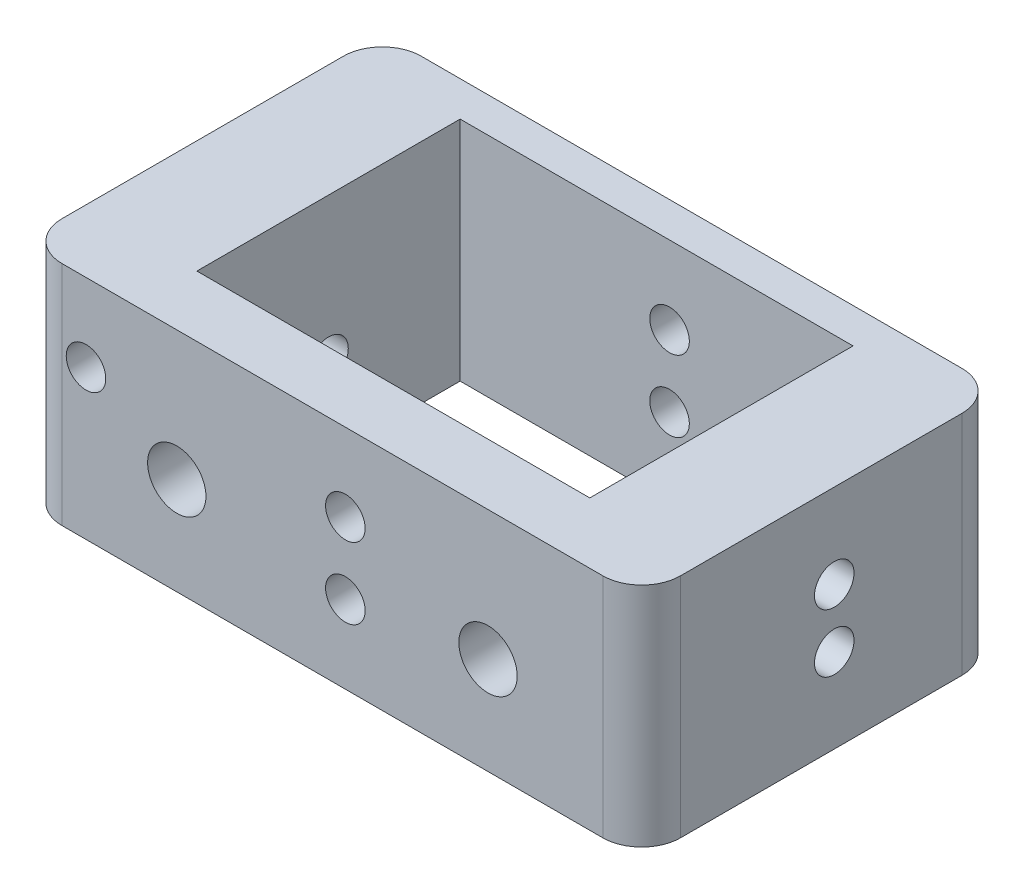
ISO-10303-21;
HEADER;
FILE_DESCRIPTION(('STEP AP214'),'2;1');
FILE_NAME('part.step','',(''),(''),'','','');
FILE_SCHEMA(('AUTOMOTIVE_DESIGN { 1 0 10303 214 1 1 1 1 }'));
ENDSEC;
DATA;
#1=APPLICATION_CONTEXT('core data for automotive mechanical design processes');
#2=APPLICATION_PROTOCOL_DEFINITION('international standard','automotive_design',2000,#1);
#3=PRODUCT_CONTEXT('',#1,'mechanical');
#4=PRODUCT('Part','Part','',(#3));
#5=PRODUCT_RELATED_PRODUCT_CATEGORY('part','',(#4));
#6=PRODUCT_DEFINITION_FORMATION('','',#4);
#7=PRODUCT_DEFINITION_CONTEXT('part definition',#1,'design');
#8=PRODUCT_DEFINITION('design','',#6,#7);
#9=PRODUCT_DEFINITION_SHAPE('','',#8);
#10=(LENGTH_UNIT() NAMED_UNIT(*) SI_UNIT(.MILLI.,.METRE.));
#11=(NAMED_UNIT(*) PLANE_ANGLE_UNIT() SI_UNIT($,.RADIAN.));
#12=(NAMED_UNIT(*) SI_UNIT($,.STERADIAN.) SOLID_ANGLE_UNIT());
#13=UNCERTAINTY_MEASURE_WITH_UNIT(LENGTH_MEASURE(1.E-05),#10,'distance_accuracy_value','');
#14=(GEOMETRIC_REPRESENTATION_CONTEXT(3) GLOBAL_UNCERTAINTY_ASSIGNED_CONTEXT((#13)) GLOBAL_UNIT_ASSIGNED_CONTEXT((#10,
#11,#12)) REPRESENTATION_CONTEXT('',''));
#15=CARTESIAN_POINT('',(0.,0.,0.));
#16=DIRECTION('',(0.,0.,1.));
#17=DIRECTION('',(1.,0.,0.));
#18=AXIS2_PLACEMENT_3D('',#15,#16,#17);
#19=CARTESIAN_POINT('',(0.,8.75,0.));
#20=DIRECTION('',(0.,-1.,0.));
#21=DIRECTION('',(0.,0.,-1.));
#22=AXIS2_PLACEMENT_3D('',#19,#20,#21);
#23=PLANE('',#22);
#24=DIRECTION('',(1.,0.,0.));
#25=VECTOR('',#24,1.);
#26=CARTESIAN_POINT('',(-23.85,8.75,13.85));
#27=LINE('',#26,#25);
#28=CARTESIAN_POINT('',(-20.85,8.75,13.85));
#29=VERTEX_POINT('',#28);
#30=CARTESIAN_POINT('',(20.85,8.75,13.85));
#31=VERTEX_POINT('',#30);
#32=EDGE_CURVE('E199',#29,#31,#27,.T.);
#33=ORIENTED_EDGE('',*,*,#32,.T.);
#34=CARTESIAN_POINT('',(20.85,8.75,10.85));
#35=DIRECTION('',(0.,-1.,0.));
#36=DIRECTION('',(0.,0.,-1.));
#37=AXIS2_PLACEMENT_3D('',#34,#35,#36);
#38=CIRCLE('',#37,3.);
#39=CARTESIAN_POINT('',(23.85,8.75,10.85));
#40=VERTEX_POINT('',#39);
#41=EDGE_CURVE('E277',#31,#40,#38,.F.);
#42=ORIENTED_EDGE('',*,*,#41,.T.);
#43=DIRECTION('',(0.,0.,-1.));
#44=VECTOR('',#43,1.);
#45=CARTESIAN_POINT('',(23.85,8.75,13.85));
#46=LINE('',#45,#44);
#47=CARTESIAN_POINT('',(23.85,8.75,-10.85));
#48=VERTEX_POINT('',#47);
#49=EDGE_CURVE('E189',#40,#48,#46,.T.);
#50=ORIENTED_EDGE('',*,*,#49,.T.);
#51=CARTESIAN_POINT('',(20.85,8.75,-10.85));
#52=DIRECTION('',(0.,-1.,0.));
#53=DIRECTION('',(0.,0.,-1.));
#54=AXIS2_PLACEMENT_3D('',#51,#52,#53);
#55=CIRCLE('',#54,3.);
#56=CARTESIAN_POINT('',(20.85,8.75,-13.85));
#57=VERTEX_POINT('',#56);
#58=EDGE_CURVE('E272',#48,#57,#55,.F.);
#59=ORIENTED_EDGE('',*,*,#58,.T.);
#60=DIRECTION('',(-1.,0.,0.));
#61=VECTOR('',#60,1.);
#62=CARTESIAN_POINT('',(-23.85,8.75,-13.85));
#63=LINE('',#62,#61);
#64=CARTESIAN_POINT('',(-20.85,8.75,-13.85));
#65=VERTEX_POINT('',#64);
#66=EDGE_CURVE('E193',#57,#65,#63,.T.);
#67=ORIENTED_EDGE('',*,*,#66,.T.);
#68=CARTESIAN_POINT('',(-20.85,8.75,-10.85));
#69=DIRECTION('',(0.,-1.,0.));
#70=DIRECTION('',(0.,0.,-1.));
#71=AXIS2_PLACEMENT_3D('',#68,#69,#70);
#72=CIRCLE('',#71,3.);
#73=CARTESIAN_POINT('',(-23.85,8.75,-10.85));
#74=VERTEX_POINT('',#73);
#75=EDGE_CURVE('E63',#65,#74,#72,.F.);
#76=ORIENTED_EDGE('',*,*,#75,.T.);
#77=DIRECTION('',(0.,0.,1.));
#78=VECTOR('',#77,1.);
#79=CARTESIAN_POINT('',(-23.85,8.75,13.85));
#80=LINE('',#79,#78);
#81=CARTESIAN_POINT('',(-23.85,8.75,10.85));
#82=VERTEX_POINT('',#81);
#83=EDGE_CURVE('E197',#74,#82,#80,.T.);
#84=ORIENTED_EDGE('',*,*,#83,.T.);
#85=CARTESIAN_POINT('',(-20.85,8.75,10.85));
#86=DIRECTION('',(0.,-1.,0.));
#87=DIRECTION('',(0.,0.,-1.));
#88=AXIS2_PLACEMENT_3D('',#85,#86,#87);
#89=CIRCLE('',#88,3.);
#90=EDGE_CURVE('E269',#82,#29,#89,.F.);
#91=ORIENTED_EDGE('',*,*,#90,.T.);
#92=EDGE_LOOP('',(#33,#42,#50,#59,#67,#76,#84,#91));
#93=FACE_BOUND('',#92,.T.);
#94=DIRECTION('',(0.,0.,-1.));
#95=VECTOR('',#94,1.);
#96=CARTESIAN_POINT('',(15.15,8.75,9.15));
#97=LINE('',#96,#95);
#98=CARTESIAN_POINT('',(15.15,8.75,9.15));
#99=VERTEX_POINT('',#98);
#100=CARTESIAN_POINT('',(15.15,8.75,-11.15));
#101=VERTEX_POINT('',#100);
#102=EDGE_CURVE('E132',#99,#101,#97,.T.);
#103=ORIENTED_EDGE('',*,*,#102,.F.);
#104=DIRECTION('',(1.,0.,0.));
#105=VECTOR('',#104,1.);
#106=CARTESIAN_POINT('',(-15.15,8.75,9.15));
#107=LINE('',#106,#105);
#108=CARTESIAN_POINT('',(-15.15,8.75,9.15));
#109=VERTEX_POINT('',#108);
#110=EDGE_CURVE('E163',#109,#99,#107,.T.);
#111=ORIENTED_EDGE('',*,*,#110,.F.);
#112=DIRECTION('',(0.,0.,1.));
#113=VECTOR('',#112,1.);
#114=CARTESIAN_POINT('',(-15.15,8.75,9.15));
#115=LINE('',#114,#113);
#116=CARTESIAN_POINT('',(-15.15,8.75,-11.15));
#117=VERTEX_POINT('',#116);
#118=EDGE_CURVE('E157',#117,#109,#115,.T.);
#119=ORIENTED_EDGE('',*,*,#118,.F.);
#120=DIRECTION('',(-1.,0.,0.));
#121=VECTOR('',#120,1.);
#122=CARTESIAN_POINT('',(-15.15,8.75,-11.15));
#123=LINE('',#122,#121);
#124=EDGE_CURVE('E143',#101,#117,#123,.T.);
#125=ORIENTED_EDGE('',*,*,#124,.F.);
#126=EDGE_LOOP('',(#103,#111,#119,#125));
#127=FACE_BOUND('',#126,.T.);
#128=ADVANCED_FACE('F40',(#93,#127),#23,.F.);
#129=CARTESIAN_POINT('',(0.,-8.75,0.));
#130=DIRECTION('',(0.,-1.,0.));
#131=DIRECTION('',(0.,0.,-1.));
#132=AXIS2_PLACEMENT_3D('',#129,#130,#131);
#133=PLANE('',#132);
#134=DIRECTION('',(0.,0.,-1.));
#135=VECTOR('',#134,1.);
#136=CARTESIAN_POINT('',(23.85,-8.75,13.85));
#137=LINE('',#136,#135);
#138=CARTESIAN_POINT('',(23.85,-8.75,10.85));
#139=VERTEX_POINT('',#138);
#140=CARTESIAN_POINT('',(23.85,-8.75,-10.85));
#141=VERTEX_POINT('',#140);
#142=EDGE_CURVE('E152',#139,#141,#137,.T.);
#143=ORIENTED_EDGE('',*,*,#142,.F.);
#144=CARTESIAN_POINT('',(20.85,-8.75,10.85));
#145=DIRECTION('',(0.,-1.,0.));
#146=DIRECTION('',(0.,0.,-1.));
#147=AXIS2_PLACEMENT_3D('',#144,#145,#146);
#148=CIRCLE('',#147,3.);
#149=CARTESIAN_POINT('',(20.85,-8.75,13.85));
#150=VERTEX_POINT('',#149);
#151=EDGE_CURVE('E259',#139,#150,#148,.T.);
#152=ORIENTED_EDGE('',*,*,#151,.T.);
#153=DIRECTION('',(1.,0.,0.));
#154=VECTOR('',#153,1.);
#155=CARTESIAN_POINT('',(-23.85,-8.75,13.85));
#156=LINE('',#155,#154);
#157=CARTESIAN_POINT('',(-20.85,-8.75,13.85));
#158=VERTEX_POINT('',#157);
#159=EDGE_CURVE('E194',#158,#150,#156,.T.);
#160=ORIENTED_EDGE('',*,*,#159,.F.);
#161=CARTESIAN_POINT('',(-20.85,-8.75,10.85));
#162=DIRECTION('',(0.,-1.,0.));
#163=DIRECTION('',(0.,0.,-1.));
#164=AXIS2_PLACEMENT_3D('',#161,#162,#163);
#165=CIRCLE('',#164,3.);
#166=CARTESIAN_POINT('',(-23.85,-8.75,10.85));
#167=VERTEX_POINT('',#166);
#168=EDGE_CURVE('E250',#158,#167,#165,.T.);
#169=ORIENTED_EDGE('',*,*,#168,.T.);
#170=DIRECTION('',(0.,0.,1.));
#171=VECTOR('',#170,1.);
#172=CARTESIAN_POINT('',(-23.85,-8.75,13.85));
#173=LINE('',#172,#171);
#174=CARTESIAN_POINT('',(-23.85,-8.75,-10.85));
#175=VERTEX_POINT('',#174);
#176=EDGE_CURVE('E211',#175,#167,#173,.T.);
#177=ORIENTED_EDGE('',*,*,#176,.F.);
#178=CARTESIAN_POINT('',(-20.85,-8.75,-10.85));
#179=DIRECTION('',(0.,-1.,0.));
#180=DIRECTION('',(0.,0.,-1.));
#181=AXIS2_PLACEMENT_3D('',#178,#179,#180);
#182=CIRCLE('',#181,3.);
#183=CARTESIAN_POINT('',(-20.85,-8.75,-13.85));
#184=VERTEX_POINT('',#183);
#185=EDGE_CURVE('E256',#175,#184,#182,.T.);
#186=ORIENTED_EDGE('',*,*,#185,.T.);
#187=DIRECTION('',(-1.,0.,0.));
#188=VECTOR('',#187,1.);
#189=CARTESIAN_POINT('',(-23.85,-8.75,-13.85));
#190=LINE('',#189,#188);
#191=CARTESIAN_POINT('',(20.85,-8.75,-13.85));
#192=VERTEX_POINT('',#191);
#193=EDGE_CURVE('E207',#192,#184,#190,.T.);
#194=ORIENTED_EDGE('',*,*,#193,.F.);
#195=CARTESIAN_POINT('',(20.85,-8.75,-10.85));
#196=DIRECTION('',(0.,-1.,0.));
#197=DIRECTION('',(0.,0.,-1.));
#198=AXIS2_PLACEMENT_3D('',#195,#196,#197);
#199=CIRCLE('',#198,3.);
#200=EDGE_CURVE('E253',#192,#141,#199,.T.);
#201=ORIENTED_EDGE('',*,*,#200,.T.);
#202=EDGE_LOOP('',(#143,#152,#160,#169,#177,#186,#194,#201));
#203=FACE_BOUND('',#202,.T.);
#204=DIRECTION('',(1.,0.,0.));
#205=VECTOR('',#204,1.);
#206=CARTESIAN_POINT('',(-15.15,-8.75,9.15));
#207=LINE('',#206,#205);
#208=CARTESIAN_POINT('',(-15.15,-8.75,9.15));
#209=VERTEX_POINT('',#208);
#210=CARTESIAN_POINT('',(15.15,-8.75,9.15));
#211=VERTEX_POINT('',#210);
#212=EDGE_CURVE('E144',#209,#211,#207,.T.);
#213=ORIENTED_EDGE('',*,*,#212,.T.);
#214=DIRECTION('',(0.,0.,-1.));
#215=VECTOR('',#214,1.);
#216=CARTESIAN_POINT('',(15.15,-8.75,9.15));
#217=LINE('',#216,#215);
#218=CARTESIAN_POINT('',(15.15,-8.75,-11.15));
#219=VERTEX_POINT('',#218);
#220=EDGE_CURVE('E169',#211,#219,#217,.T.);
#221=ORIENTED_EDGE('',*,*,#220,.T.);
#222=DIRECTION('',(-1.,0.,0.));
#223=VECTOR('',#222,1.);
#224=CARTESIAN_POINT('',(-15.15,-8.75,-11.15));
#225=LINE('',#224,#223);
#226=CARTESIAN_POINT('',(-15.15,-8.75,-11.15));
#227=VERTEX_POINT('',#226);
#228=EDGE_CURVE('E150',#219,#227,#225,.T.);
#229=ORIENTED_EDGE('',*,*,#228,.T.);
#230=DIRECTION('',(0.,0.,1.));
#231=VECTOR('',#230,1.);
#232=CARTESIAN_POINT('',(-15.15,-8.75,9.15));
#233=LINE('',#232,#231);
#234=EDGE_CURVE('E175',#227,#209,#233,.T.);
#235=ORIENTED_EDGE('',*,*,#234,.T.);
#236=EDGE_LOOP('',(#213,#221,#229,#235));
#237=FACE_BOUND('',#236,.T.);
#238=ADVANCED_FACE('F297',(#203,#237),#133,.T.);
#239=CARTESIAN_POINT('',(23.85,8.75,13.85));
#240=DIRECTION('',(-1.,0.,0.));
#241=DIRECTION('',(0.,0.,1.));
#242=AXIS2_PLACEMENT_3D('',#239,#240,#241);
#243=PLANE('',#242);
#244=CARTESIAN_POINT('',(23.85,2.25,-1.00000000000005));
#245=DIRECTION('',(1.,0.,0.));
#246=DIRECTION('',(0.,0.,-1.));
#247=AXIS2_PLACEMENT_3D('',#244,#245,#246);
#248=CIRCLE('',#247,1.525);
#249=CARTESIAN_POINT('',(23.85,2.25,-2.52500000000005));
#250=VERTEX_POINT('',#249);
#251=EDGE_CURVE('E450',#250,#250,#248,.T.);
#252=ORIENTED_EDGE('',*,*,#251,.F.);
#253=EDGE_LOOP('',(#252));
#254=FACE_BOUND('',#253,.T.);
#255=CARTESIAN_POINT('',(23.85,-2.25,-0.999999999999973));
#256=DIRECTION('',(1.,0.,0.));
#257=DIRECTION('',(0.,0.,-1.));
#258=AXIS2_PLACEMENT_3D('',#255,#256,#257);
#259=CIRCLE('',#258,1.525);
#260=CARTESIAN_POINT('',(23.85,-2.25,-2.52499999999997));
#261=VERTEX_POINT('',#260);
#262=EDGE_CURVE('E420',#261,#261,#259,.T.);
#263=ORIENTED_EDGE('',*,*,#262,.F.);
#264=EDGE_LOOP('',(#263));
#265=FACE_BOUND('',#264,.T.);
#266=ORIENTED_EDGE('',*,*,#49,.F.);
#267=DIRECTION('',(0.,-1.,0.));
#268=VECTOR('',#267,1.);
#269=CARTESIAN_POINT('',(23.85,8.75,10.85));
#270=LINE('',#269,#268);
#271=EDGE_CURVE('E246',#40,#139,#270,.T.);
#272=ORIENTED_EDGE('',*,*,#271,.T.);
#273=ORIENTED_EDGE('',*,*,#142,.T.);
#274=DIRECTION('',(0.,-1.,0.));
#275=VECTOR('',#274,1.);
#276=CARTESIAN_POINT('',(23.85,8.75,-10.85));
#277=LINE('',#276,#275);
#278=EDGE_CURVE('E203',#141,#48,#277,.F.);
#279=ORIENTED_EDGE('',*,*,#278,.T.);
#280=EDGE_LOOP('',(#266,#272,#273,#279));
#281=FACE_BOUND('',#280,.T.);
#282=ADVANCED_FACE('F318',(#254,#265,#281),#243,.F.);
#283=CARTESIAN_POINT('',(-23.85,8.75,-13.85));
#284=DIRECTION('',(0.,0.,1.));
#285=DIRECTION('',(1.,0.,0.));
#286=AXIS2_PLACEMENT_3D('',#283,#284,#285);
#287=PLANE('',#286);
#288=CARTESIAN_POINT('',(1.000000000001,-2.75,-13.85));
#289=DIRECTION('',(0.,0.,1.));
#290=DIRECTION('',(1.,0.,0.));
#291=AXIS2_PLACEMENT_3D('',#288,#289,#290);
#292=CIRCLE('',#291,1.52500000000001);
#293=CARTESIAN_POINT('',(2.52500000000102,-2.75,-13.85));
#294=VERTEX_POINT('',#293);
#295=EDGE_CURVE('E438',#294,#294,#292,.T.);
#296=ORIENTED_EDGE('',*,*,#295,.T.);
#297=EDGE_LOOP('',(#296));
#298=FACE_BOUND('',#297,.T.);
#299=CARTESIAN_POINT('',(-18.999999999999,2.75000000000017,-13.85));
#300=DIRECTION('',(0.,0.,-1.));
#301=DIRECTION('',(-1.,0.,0.));
#302=AXIS2_PLACEMENT_3D('',#299,#300,#301);
#303=CIRCLE('',#302,1.52499999999997);
#304=CARTESIAN_POINT('',(-20.524999999999,2.75000000000017,-13.85));
#305=VERTEX_POINT('',#304);
#306=EDGE_CURVE('E237',#305,#305,#303,.T.);
#307=ORIENTED_EDGE('',*,*,#306,.F.);
#308=EDGE_LOOP('',(#307));
#309=FACE_BOUND('',#308,.T.);
#310=CARTESIAN_POINT('',(1.000000000001,2.75000000000009,-13.85));
#311=DIRECTION('',(0.,0.,-1.));
#312=DIRECTION('',(-1.,0.,0.));
#313=AXIS2_PLACEMENT_3D('',#310,#311,#312);
#314=CIRCLE('',#313,1.52499999999997);
#315=CARTESIAN_POINT('',(-0.524999999998968,2.75000000000009,-13.85));
#316=VERTEX_POINT('',#315);
#317=EDGE_CURVE('E411',#316,#316,#314,.T.);
#318=ORIENTED_EDGE('',*,*,#317,.F.);
#319=EDGE_LOOP('',(#318));
#320=FACE_BOUND('',#319,.T.);
#321=ORIENTED_EDGE('',*,*,#193,.T.);
#322=DIRECTION('',(0.,-1.,0.));
#323=VECTOR('',#322,1.);
#324=CARTESIAN_POINT('',(-20.85,8.75,-13.85));
#325=LINE('',#324,#323);
#326=EDGE_CURVE('E11',#184,#65,#325,.F.);
#327=ORIENTED_EDGE('',*,*,#326,.T.);
#328=ORIENTED_EDGE('',*,*,#66,.F.);
#329=DIRECTION('',(0.,-1.,0.));
#330=VECTOR('',#329,1.);
#331=CARTESIAN_POINT('',(20.85,8.75,-13.85));
#332=LINE('',#331,#330);
#333=EDGE_CURVE('E49',#57,#192,#332,.T.);
#334=ORIENTED_EDGE('',*,*,#333,.T.);
#335=EDGE_LOOP('',(#321,#327,#328,#334));
#336=FACE_BOUND('',#335,.T.);
#337=ADVANCED_FACE('F291',(#298,#309,#320,#336),#287,.F.);
#338=CARTESIAN_POINT('',(-23.85,8.75,13.85));
#339=DIRECTION('',(1.,0.,0.));
#340=DIRECTION('',(0.,0.,-1.));
#341=AXIS2_PLACEMENT_3D('',#338,#339,#340);
#342=PLANE('',#341);
#343=CARTESIAN_POINT('',(-23.85,-2.25,-0.999999999999973));
#344=DIRECTION('',(1.,0.,0.));
#345=DIRECTION('',(0.,0.,-1.));
#346=AXIS2_PLACEMENT_3D('',#343,#344,#345);
#347=CIRCLE('',#346,1.525);
#348=CARTESIAN_POINT('',(-23.85,-2.25,-2.52499999999997));
#349=VERTEX_POINT('',#348);
#350=EDGE_CURVE('E227',#349,#349,#347,.T.);
#351=ORIENTED_EDGE('',*,*,#350,.T.);
#352=EDGE_LOOP('',(#351));
#353=FACE_BOUND('',#352,.T.);
#354=ORIENTED_EDGE('',*,*,#83,.F.);
#355=DIRECTION('',(0.,-1.,0.));
#356=VECTOR('',#355,1.);
#357=CARTESIAN_POINT('',(-23.85,8.75,-10.85));
#358=LINE('',#357,#356);
#359=EDGE_CURVE('E282',#74,#175,#358,.T.);
#360=ORIENTED_EDGE('',*,*,#359,.T.);
#361=ORIENTED_EDGE('',*,*,#176,.T.);
#362=DIRECTION('',(0.,-1.,0.));
#363=VECTOR('',#362,1.);
#364=CARTESIAN_POINT('',(-23.85,8.75,10.85));
#365=LINE('',#364,#363);
#366=EDGE_CURVE('E56',#167,#82,#365,.F.);
#367=ORIENTED_EDGE('',*,*,#366,.T.);
#368=EDGE_LOOP('',(#354,#360,#361,#367));
#369=FACE_BOUND('',#368,.T.);
#370=ADVANCED_FACE('F303',(#353,#369),#342,.F.);
#371=CARTESIAN_POINT('',(-23.85,8.75,13.85));
#372=DIRECTION('',(0.,0.,-1.));
#373=DIRECTION('',(-1.,0.,0.));
#374=AXIS2_PLACEMENT_3D('',#371,#372,#373);
#375=PLANE('',#374);
#376=CARTESIAN_POINT('',(1.000000000001,-2.75,13.85));
#377=DIRECTION('',(0.,0.,-1.));
#378=DIRECTION('',(-1.,0.,0.));
#379=AXIS2_PLACEMENT_3D('',#376,#377,#378);
#380=CIRCLE('',#379,1.52500000000001);
#381=CARTESIAN_POINT('',(-0.524999999999011,-2.75,13.85));
#382=VERTEX_POINT('',#381);
#383=EDGE_CURVE('E243',#382,#382,#380,.T.);
#384=ORIENTED_EDGE('',*,*,#383,.T.);
#385=EDGE_LOOP('',(#384));
#386=FACE_BOUND('',#385,.T.);
#387=CARTESIAN_POINT('',(-12.0000000000443,-1.25000000000219,13.85));
#388=DIRECTION('',(0.,0.,1.));
#389=DIRECTION('',(1.,0.,0.));
#390=AXIS2_PLACEMENT_3D('',#387,#388,#389);
#391=CIRCLE('',#390,2.25);
#392=CARTESIAN_POINT('',(-9.75000000004425,-1.25000000000219,13.85));
#393=VERTEX_POINT('',#392);
#394=EDGE_CURVE('E233',#393,#393,#391,.T.);
#395=ORIENTED_EDGE('',*,*,#394,.F.);
#396=EDGE_LOOP('',(#395));
#397=FACE_BOUND('',#396,.T.);
#398=CARTESIAN_POINT('',(12.0000000000013,-1.25000000000008,13.85));
#399=DIRECTION('',(0.,0.,1.));
#400=DIRECTION('',(1.,0.,0.));
#401=AXIS2_PLACEMENT_3D('',#398,#399,#400);
#402=CIRCLE('',#401,2.25);
#403=CARTESIAN_POINT('',(14.2500000000013,-1.25000000000008,13.85));
#404=VERTEX_POINT('',#403);
#405=EDGE_CURVE('E434',#404,#404,#402,.T.);
#406=ORIENTED_EDGE('',*,*,#405,.F.);
#407=EDGE_LOOP('',(#406));
#408=FACE_BOUND('',#407,.T.);
#409=CARTESIAN_POINT('',(-18.999999999999,2.75000000000017,13.85));
#410=DIRECTION('',(0.,0.,-1.));
#411=DIRECTION('',(-1.,0.,0.));
#412=AXIS2_PLACEMENT_3D('',#409,#410,#411);
#413=CIRCLE('',#412,1.52499999999997);
#414=CARTESIAN_POINT('',(-20.524999999999,2.75000000000017,13.85));
#415=VERTEX_POINT('',#414);
#416=EDGE_CURVE('E424',#415,#415,#413,.T.);
#417=ORIENTED_EDGE('',*,*,#416,.T.);
#418=EDGE_LOOP('',(#417));
#419=FACE_BOUND('',#418,.T.);
#420=CARTESIAN_POINT('',(1.000000000001,2.75000000000009,13.85));
#421=DIRECTION('',(0.,0.,-1.));
#422=DIRECTION('',(-1.,0.,0.));
#423=AXIS2_PLACEMENT_3D('',#420,#421,#422);
#424=CIRCLE('',#423,1.52499999999997);
#425=CARTESIAN_POINT('',(-0.524999999998968,2.75000000000009,13.85));
#426=VERTEX_POINT('',#425);
#427=EDGE_CURVE('E221',#426,#426,#424,.T.);
#428=ORIENTED_EDGE('',*,*,#427,.T.);
#429=EDGE_LOOP('',(#428));
#430=FACE_BOUND('',#429,.T.);
#431=ORIENTED_EDGE('',*,*,#159,.T.);
#432=DIRECTION('',(0.,-1.,0.));
#433=VECTOR('',#432,1.);
#434=CARTESIAN_POINT('',(20.85,8.75,13.85));
#435=LINE('',#434,#433);
#436=EDGE_CURVE('E266',#150,#31,#435,.F.);
#437=ORIENTED_EDGE('',*,*,#436,.T.);
#438=ORIENTED_EDGE('',*,*,#32,.F.);
#439=DIRECTION('',(0.,-1.,0.));
#440=VECTOR('',#439,1.);
#441=CARTESIAN_POINT('',(-20.85,8.75,13.85));
#442=LINE('',#441,#440);
#443=EDGE_CURVE('E262',#29,#158,#442,.T.);
#444=ORIENTED_EDGE('',*,*,#443,.T.);
#445=EDGE_LOOP('',(#431,#437,#438,#444));
#446=FACE_BOUND('',#445,.T.);
#447=ADVANCED_FACE('F310',(#386,#397,#408,#419,#430,#446),#375,.F.);
#448=CARTESIAN_POINT('',(15.15,8.75,9.15));
#449=DIRECTION('',(-1.,0.,0.));
#450=DIRECTION('',(0.,0.,1.));
#451=AXIS2_PLACEMENT_3D('',#448,#449,#450);
#452=PLANE('',#451);
#453=CARTESIAN_POINT('',(15.15,2.25,-1.00000000000005));
#454=DIRECTION('',(-1.,0.,0.));
#455=DIRECTION('',(0.,0.,1.));
#456=AXIS2_PLACEMENT_3D('',#453,#454,#455);
#457=CIRCLE('',#456,1.525);
#458=CARTESIAN_POINT('',(15.15,2.25,0.524999999999951));
#459=VERTEX_POINT('',#458);
#460=EDGE_CURVE('E454',#459,#459,#457,.F.);
#461=ORIENTED_EDGE('',*,*,#460,.T.);
#462=EDGE_LOOP('',(#461));
#463=FACE_BOUND('',#462,.T.);
#464=CARTESIAN_POINT('',(15.15,-2.25,-0.999999999999973));
#465=DIRECTION('',(-1.,0.,0.));
#466=DIRECTION('',(0.,0.,1.));
#467=AXIS2_PLACEMENT_3D('',#464,#465,#466);
#468=CIRCLE('',#467,1.525);
#469=CARTESIAN_POINT('',(15.15,-2.25,0.525000000000027));
#470=VERTEX_POINT('',#469);
#471=EDGE_CURVE('E226',#470,#470,#468,.T.);
#472=ORIENTED_EDGE('',*,*,#471,.F.);
#473=EDGE_LOOP('',(#472));
#474=FACE_BOUND('',#473,.T.);
#475=ORIENTED_EDGE('',*,*,#220,.F.);
#476=DIRECTION('',(0.,-1.,0.));
#477=VECTOR('',#476,1.);
#478=CARTESIAN_POINT('',(15.15,8.75,9.15));
#479=LINE('',#478,#477);
#480=EDGE_CURVE('E138',#99,#211,#479,.T.);
#481=ORIENTED_EDGE('',*,*,#480,.F.);
#482=ORIENTED_EDGE('',*,*,#102,.T.);
#483=DIRECTION('',(0.,-1.,0.));
#484=VECTOR('',#483,1.);
#485=CARTESIAN_POINT('',(15.15,8.75,-11.15));
#486=LINE('',#485,#484);
#487=EDGE_CURVE('E135',#101,#219,#486,.T.);
#488=ORIENTED_EDGE('',*,*,#487,.T.);
#489=EDGE_LOOP('',(#475,#481,#482,#488));
#490=FACE_BOUND('',#489,.T.);
#491=ADVANCED_FACE('F134',(#463,#474,#490),#452,.T.);
#492=CARTESIAN_POINT('',(-15.15,8.75,-11.15));
#493=DIRECTION('',(0.,0.,1.));
#494=DIRECTION('',(1.,0.,0.));
#495=AXIS2_PLACEMENT_3D('',#492,#493,#494);
#496=PLANE('',#495);
#497=CARTESIAN_POINT('',(1.000000000001,-2.75,-11.15));
#498=DIRECTION('',(0.,0.,1.));
#499=DIRECTION('',(1.,0.,0.));
#500=AXIS2_PLACEMENT_3D('',#497,#498,#499);
#501=CIRCLE('',#500,1.52500000000001);
#502=CARTESIAN_POINT('',(2.52500000000102,-2.75,-11.15));
#503=VERTEX_POINT('',#502);
#504=EDGE_CURVE('E242',#503,#503,#501,.T.);
#505=ORIENTED_EDGE('',*,*,#504,.F.);
#506=EDGE_LOOP('',(#505));
#507=FACE_BOUND('',#506,.T.);
#508=CARTESIAN_POINT('',(1.000000000001,2.75000000000009,-11.15));
#509=DIRECTION('',(0.,0.,1.));
#510=DIRECTION('',(1.,0.,0.));
#511=AXIS2_PLACEMENT_3D('',#508,#509,#510);
#512=CIRCLE('',#511,1.52499999999997);
#513=CARTESIAN_POINT('',(2.52500000000097,2.75000000000009,-11.15));
#514=VERTEX_POINT('',#513);
#515=EDGE_CURVE('E172',#514,#514,#512,.T.);
#516=ORIENTED_EDGE('',*,*,#515,.F.);
#517=EDGE_LOOP('',(#516));
#518=FACE_BOUND('',#517,.T.);
#519=ORIENTED_EDGE('',*,*,#228,.F.);
#520=ORIENTED_EDGE('',*,*,#487,.F.);
#521=ORIENTED_EDGE('',*,*,#124,.T.);
#522=DIRECTION('',(0.,-1.,0.));
#523=VECTOR('',#522,1.);
#524=CARTESIAN_POINT('',(-15.15,8.75,-11.15));
#525=LINE('',#524,#523);
#526=EDGE_CURVE('E153',#117,#227,#525,.T.);
#527=ORIENTED_EDGE('',*,*,#526,.T.);
#528=EDGE_LOOP('',(#519,#520,#521,#527));
#529=FACE_BOUND('',#528,.T.);
#530=ADVANCED_FACE('F147',(#507,#518,#529),#496,.T.);
#531=CARTESIAN_POINT('',(-15.15,8.75,9.15));
#532=DIRECTION('',(1.,0.,0.));
#533=DIRECTION('',(0.,0.,-1.));
#534=AXIS2_PLACEMENT_3D('',#531,#532,#533);
#535=PLANE('',#534);
#536=CARTESIAN_POINT('',(-15.15,-2.25,-0.999999999999973));
#537=DIRECTION('',(1.,0.,0.));
#538=DIRECTION('',(0.,0.,-1.));
#539=AXIS2_PLACEMENT_3D('',#536,#537,#538);
#540=CIRCLE('',#539,1.525);
#541=CARTESIAN_POINT('',(-15.15,-2.25,-2.52499999999997));
#542=VERTEX_POINT('',#541);
#543=EDGE_CURVE('E222',#542,#542,#540,.T.);
#544=ORIENTED_EDGE('',*,*,#543,.F.);
#545=EDGE_LOOP('',(#544));
#546=FACE_BOUND('',#545,.T.);
#547=ORIENTED_EDGE('',*,*,#234,.F.);
#548=ORIENTED_EDGE('',*,*,#526,.F.);
#549=ORIENTED_EDGE('',*,*,#118,.T.);
#550=DIRECTION('',(0.,-1.,0.));
#551=VECTOR('',#550,1.);
#552=CARTESIAN_POINT('',(-15.15,8.75,9.15));
#553=LINE('',#552,#551);
#554=EDGE_CURVE('E184',#109,#209,#553,.T.);
#555=ORIENTED_EDGE('',*,*,#554,.T.);
#556=EDGE_LOOP('',(#547,#548,#549,#555));
#557=FACE_BOUND('',#556,.T.);
#558=ADVANCED_FACE('F392',(#546,#557),#535,.T.);
#559=CARTESIAN_POINT('',(-15.15,8.75,9.15));
#560=DIRECTION('',(0.,0.,-1.));
#561=DIRECTION('',(-1.,0.,0.));
#562=AXIS2_PLACEMENT_3D('',#559,#560,#561);
#563=PLANE('',#562);
#564=CARTESIAN_POINT('',(1.000000000001,-2.75,9.15));
#565=DIRECTION('',(0.,0.,-1.));
#566=DIRECTION('',(-1.,0.,0.));
#567=AXIS2_PLACEMENT_3D('',#564,#565,#566);
#568=CIRCLE('',#567,1.52500000000001);
#569=CARTESIAN_POINT('',(-0.524999999999011,-2.75,9.15));
#570=VERTEX_POINT('',#569);
#571=EDGE_CURVE('E238',#570,#570,#568,.T.);
#572=ORIENTED_EDGE('',*,*,#571,.F.);
#573=EDGE_LOOP('',(#572));
#574=FACE_BOUND('',#573,.T.);
#575=CARTESIAN_POINT('',(-12.0000000000443,-1.25000000000219,9.15));
#576=DIRECTION('',(0.,0.,-1.));
#577=DIRECTION('',(-1.,0.,0.));
#578=AXIS2_PLACEMENT_3D('',#575,#576,#577);
#579=CIRCLE('',#578,2.25);
#580=CARTESIAN_POINT('',(-14.2500000000443,-1.25000000000219,9.15));
#581=VERTEX_POINT('',#580);
#582=EDGE_CURVE('E232',#581,#581,#579,.T.);
#583=ORIENTED_EDGE('',*,*,#582,.F.);
#584=EDGE_LOOP('',(#583));
#585=FACE_BOUND('',#584,.T.);
#586=CARTESIAN_POINT('',(12.0000000000013,-1.25000000000008,9.15));
#587=DIRECTION('',(0.,0.,-1.));
#588=DIRECTION('',(-1.,0.,0.));
#589=AXIS2_PLACEMENT_3D('',#586,#587,#588);
#590=CIRCLE('',#589,2.25);
#591=CARTESIAN_POINT('',(9.75000000000132,-1.25000000000008,9.15));
#592=VERTEX_POINT('',#591);
#593=EDGE_CURVE('E228',#592,#592,#590,.T.);
#594=ORIENTED_EDGE('',*,*,#593,.F.);
#595=EDGE_LOOP('',(#594));
#596=FACE_BOUND('',#595,.T.);
#597=CARTESIAN_POINT('',(1.000000000001,2.75000000000009,9.15));
#598=DIRECTION('',(0.,0.,-1.));
#599=DIRECTION('',(-1.,0.,0.));
#600=AXIS2_PLACEMENT_3D('',#597,#598,#599);
#601=CIRCLE('',#600,1.52499999999997);
#602=CARTESIAN_POINT('',(-0.524999999998968,2.75000000000009,9.15));
#603=VERTEX_POINT('',#602);
#604=EDGE_CURVE('E217',#603,#603,#601,.T.);
#605=ORIENTED_EDGE('',*,*,#604,.F.);
#606=EDGE_LOOP('',(#605));
#607=FACE_BOUND('',#606,.T.);
#608=ORIENTED_EDGE('',*,*,#212,.F.);
#609=ORIENTED_EDGE('',*,*,#554,.F.);
#610=ORIENTED_EDGE('',*,*,#110,.T.);
#611=ORIENTED_EDGE('',*,*,#480,.T.);
#612=EDGE_LOOP('',(#608,#609,#610,#611));
#613=FACE_BOUND('',#612,.T.);
#614=ADVANCED_FACE('F388',(#574,#585,#596,#607,#613),#563,.T.);
#615=CARTESIAN_POINT('',(1.000000000001,2.75000000000009,13.85));
#616=DIRECTION('',(0.,0.,-1.));
#617=DIRECTION('',(-1.,0.,0.));
#618=AXIS2_PLACEMENT_3D('',#615,#616,#617);
#619=CYLINDRICAL_SURFACE('',#618,1.52499999999997);
#620=ORIENTED_EDGE('',*,*,#604,.T.);
#621=EDGE_LOOP('',(#620));
#622=FACE_BOUND('',#621,.T.);
#623=ORIENTED_EDGE('',*,*,#427,.F.);
#624=EDGE_LOOP('',(#623));
#625=FACE_BOUND('',#624,.T.);
#626=ADVANCED_FACE('F385',(#622,#625),#619,.F.);
#627=ORIENTED_EDGE('',*,*,#515,.T.);
#628=EDGE_LOOP('',(#627));
#629=FACE_BOUND('',#628,.T.);
#630=ORIENTED_EDGE('',*,*,#317,.T.);
#631=EDGE_LOOP('',(#630));
#632=FACE_BOUND('',#631,.T.);
#633=ADVANCED_FACE('F383',(#629,#632),#619,.F.);
#634=CARTESIAN_POINT('',(-23.85,-2.25,-0.999999999999973));
#635=DIRECTION('',(1.,0.,0.));
#636=DIRECTION('',(0.,0.,-1.));
#637=AXIS2_PLACEMENT_3D('',#634,#635,#636);
#638=CYLINDRICAL_SURFACE('',#637,1.525);
#639=ORIENTED_EDGE('',*,*,#543,.T.);
#640=EDGE_LOOP('',(#639));
#641=FACE_BOUND('',#640,.T.);
#642=ORIENTED_EDGE('',*,*,#350,.F.);
#643=EDGE_LOOP('',(#642));
#644=FACE_BOUND('',#643,.T.);
#645=ADVANCED_FACE('F380',(#641,#644),#638,.F.);
#646=ORIENTED_EDGE('',*,*,#471,.T.);
#647=EDGE_LOOP('',(#646));
#648=FACE_BOUND('',#647,.T.);
#649=ORIENTED_EDGE('',*,*,#262,.T.);
#650=EDGE_LOOP('',(#649));
#651=FACE_BOUND('',#650,.T.);
#652=ADVANCED_FACE('F378',(#648,#651),#638,.F.);
#653=CARTESIAN_POINT('',(-18.999999999999,2.75000000000017,13.85));
#654=DIRECTION('',(0.,0.,-1.));
#655=DIRECTION('',(-1.,0.,0.));
#656=AXIS2_PLACEMENT_3D('',#653,#654,#655);
#657=CYLINDRICAL_SURFACE('',#656,1.52499999999997);
#658=ORIENTED_EDGE('',*,*,#416,.F.);
#659=EDGE_LOOP('',(#658));
#660=FACE_BOUND('',#659,.T.);
#661=ORIENTED_EDGE('',*,*,#306,.T.);
#662=EDGE_LOOP('',(#661));
#663=FACE_BOUND('',#662,.T.);
#664=ADVANCED_FACE('F374',(#660,#663),#657,.F.);
#665=CARTESIAN_POINT('',(12.0000000000013,-1.25000000000008,8.85));
#666=DIRECTION('',(0.,0.,1.));
#667=DIRECTION('',(1.,0.,0.));
#668=AXIS2_PLACEMENT_3D('',#665,#666,#667);
#669=CYLINDRICAL_SURFACE('',#668,2.25);
#670=ORIENTED_EDGE('',*,*,#593,.T.);
#671=EDGE_LOOP('',(#670));
#672=FACE_BOUND('',#671,.T.);
#673=ORIENTED_EDGE('',*,*,#405,.T.);
#674=EDGE_LOOP('',(#673));
#675=FACE_BOUND('',#674,.T.);
#676=ADVANCED_FACE('F370',(#672,#675),#669,.F.);
#677=CARTESIAN_POINT('',(-12.0000000000443,-1.25000000000219,8.85));
#678=DIRECTION('',(0.,0.,1.));
#679=DIRECTION('',(1.,0.,0.));
#680=AXIS2_PLACEMENT_3D('',#677,#678,#679);
#681=CYLINDRICAL_SURFACE('',#680,2.25);
#682=ORIENTED_EDGE('',*,*,#582,.T.);
#683=EDGE_LOOP('',(#682));
#684=FACE_BOUND('',#683,.T.);
#685=ORIENTED_EDGE('',*,*,#394,.T.);
#686=EDGE_LOOP('',(#685));
#687=FACE_BOUND('',#686,.T.);
#688=ADVANCED_FACE('F366',(#684,#687),#681,.F.);
#689=CARTESIAN_POINT('',(1.000000000001,-2.75,13.85));
#690=DIRECTION('',(0.,0.,-1.));
#691=DIRECTION('',(-1.,0.,0.));
#692=AXIS2_PLACEMENT_3D('',#689,#690,#691);
#693=CYLINDRICAL_SURFACE('',#692,1.52500000000001);
#694=ORIENTED_EDGE('',*,*,#571,.T.);
#695=EDGE_LOOP('',(#694));
#696=FACE_BOUND('',#695,.T.);
#697=ORIENTED_EDGE('',*,*,#383,.F.);
#698=EDGE_LOOP('',(#697));
#699=FACE_BOUND('',#698,.T.);
#700=ADVANCED_FACE('F359',(#696,#699),#693,.F.);
#701=ORIENTED_EDGE('',*,*,#504,.T.);
#702=EDGE_LOOP('',(#701));
#703=FACE_BOUND('',#702,.T.);
#704=ORIENTED_EDGE('',*,*,#295,.F.);
#705=EDGE_LOOP('',(#704));
#706=FACE_BOUND('',#705,.T.);
#707=ADVANCED_FACE('F353',(#703,#706),#693,.F.);
#708=CARTESIAN_POINT('',(-23.851,2.25,-1.00000000000005));
#709=DIRECTION('',(1.,0.,0.));
#710=DIRECTION('',(0.,0.,-1.));
#711=AXIS2_PLACEMENT_3D('',#708,#709,#710);
#712=CYLINDRICAL_SURFACE('',#711,1.525);
#713=ORIENTED_EDGE('',*,*,#460,.F.);
#714=EDGE_LOOP('',(#713));
#715=FACE_BOUND('',#714,.T.);
#716=ORIENTED_EDGE('',*,*,#251,.T.);
#717=EDGE_LOOP('',(#716));
#718=FACE_BOUND('',#717,.T.);
#719=ADVANCED_FACE('F349',(#715,#718),#712,.F.);
#720=CARTESIAN_POINT('',(20.85,8.75,10.85));
#721=DIRECTION('',(0.,-1.,0.));
#722=DIRECTION('',(0.,0.,-1.));
#723=AXIS2_PLACEMENT_3D('',#720,#721,#722);
#724=CYLINDRICAL_SURFACE('',#723,3.);
#725=ORIENTED_EDGE('',*,*,#41,.F.);
#726=ORIENTED_EDGE('',*,*,#436,.F.);
#727=ORIENTED_EDGE('',*,*,#151,.F.);
#728=ORIENTED_EDGE('',*,*,#271,.F.);
#729=EDGE_LOOP('',(#725,#726,#727,#728));
#730=FACE_BOUND('',#729,.T.);
#731=ADVANCED_FACE('F315',(#730),#724,.T.);
#732=CARTESIAN_POINT('',(-20.85,8.75,-10.85));
#733=DIRECTION('',(0.,-1.,0.));
#734=DIRECTION('',(0.,0.,-1.));
#735=AXIS2_PLACEMENT_3D('',#732,#733,#734);
#736=CYLINDRICAL_SURFACE('',#735,3.);
#737=ORIENTED_EDGE('',*,*,#75,.F.);
#738=ORIENTED_EDGE('',*,*,#326,.F.);
#739=ORIENTED_EDGE('',*,*,#185,.F.);
#740=ORIENTED_EDGE('',*,*,#359,.F.);
#741=EDGE_LOOP('',(#737,#738,#739,#740));
#742=FACE_BOUND('',#741,.T.);
#743=ADVANCED_FACE('F302',(#742),#736,.T.);
#744=CARTESIAN_POINT('',(20.85,8.75,-10.85));
#745=DIRECTION('',(0.,-1.,0.));
#746=DIRECTION('',(0.,0.,-1.));
#747=AXIS2_PLACEMENT_3D('',#744,#745,#746);
#748=CYLINDRICAL_SURFACE('',#747,3.);
#749=ORIENTED_EDGE('',*,*,#58,.F.);
#750=ORIENTED_EDGE('',*,*,#278,.F.);
#751=ORIENTED_EDGE('',*,*,#200,.F.);
#752=ORIENTED_EDGE('',*,*,#333,.F.);
#753=EDGE_LOOP('',(#749,#750,#751,#752));
#754=FACE_BOUND('',#753,.T.);
#755=ADVANCED_FACE('F320',(#754),#748,.T.);
#756=CARTESIAN_POINT('',(-20.85,8.75,10.85));
#757=DIRECTION('',(0.,-1.,0.));
#758=DIRECTION('',(0.,0.,-1.));
#759=AXIS2_PLACEMENT_3D('',#756,#757,#758);
#760=CYLINDRICAL_SURFACE('',#759,3.);
#761=ORIENTED_EDGE('',*,*,#90,.F.);
#762=ORIENTED_EDGE('',*,*,#366,.F.);
#763=ORIENTED_EDGE('',*,*,#168,.F.);
#764=ORIENTED_EDGE('',*,*,#443,.F.);
#765=EDGE_LOOP('',(#761,#762,#763,#764));
#766=FACE_BOUND('',#765,.T.);
#767=ADVANCED_FACE('F42',(#766),#760,.T.);
#768=CLOSED_SHELL('',(#128,#238,#282,#337,#370,#447,#491,#530,#558,#614,#626,#633,#645,#652,
#664,#676,#688,#700,#707,#719,#731,#743,#755,#767));
#769=MANIFOLD_SOLID_BREP('B2',#768);
#770=ADVANCED_BREP_SHAPE_REPRESENTATION('',(#18,#769),#14);
#771=SHAPE_DEFINITION_REPRESENTATION(#9,#770);
ENDSEC;
END-ISO-10303-21;
